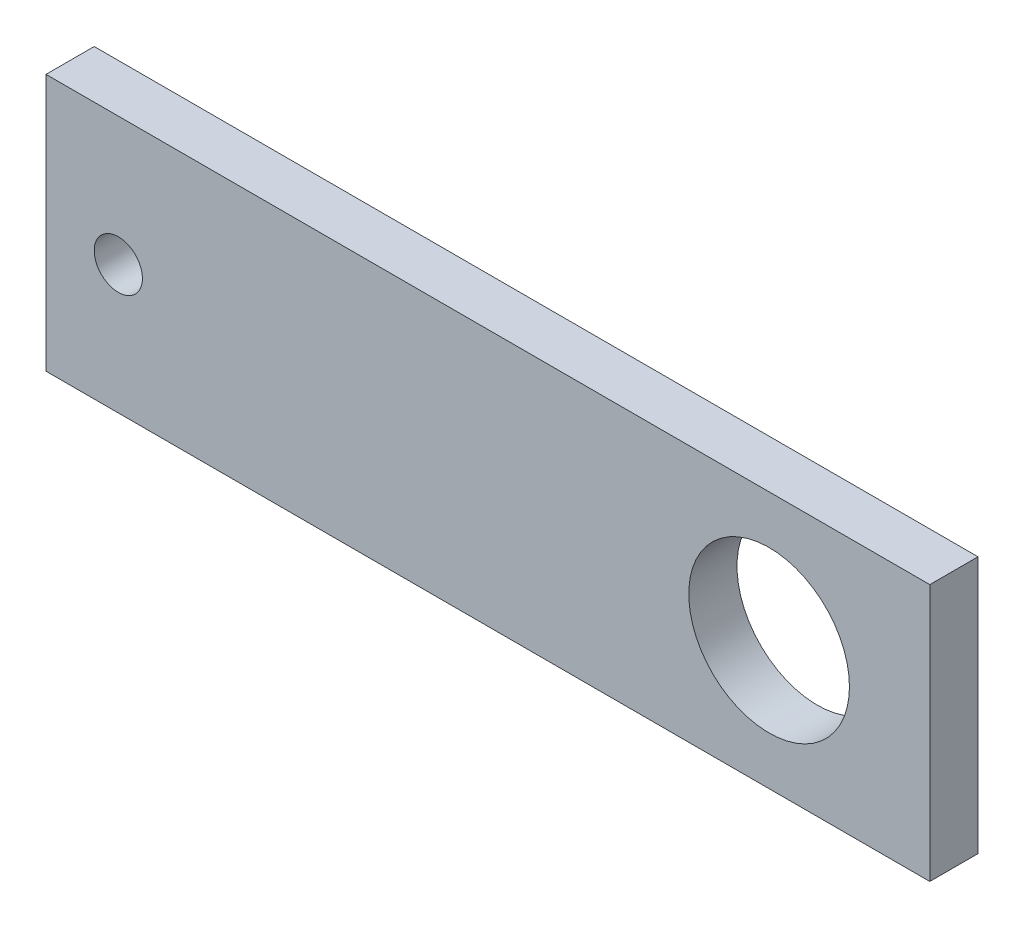
ISO-10303-21;
HEADER;
FILE_DESCRIPTION(('STEP AP214'),'2;1');
FILE_NAME('part.step','',(''),(''),'','','');
FILE_SCHEMA(('AUTOMOTIVE_DESIGN { 1 0 10303 214 1 1 1 1 }'));
ENDSEC;
DATA;
#1=APPLICATION_CONTEXT('core data for automotive mechanical design processes');
#2=APPLICATION_PROTOCOL_DEFINITION('international standard','automotive_design',2000,#1);
#3=PRODUCT_CONTEXT('',#1,'mechanical');
#4=PRODUCT('Part','Part','',(#3));
#5=PRODUCT_RELATED_PRODUCT_CATEGORY('part','',(#4));
#6=PRODUCT_DEFINITION_FORMATION('','',#4);
#7=PRODUCT_DEFINITION_CONTEXT('part definition',#1,'design');
#8=PRODUCT_DEFINITION('design','',#6,#7);
#9=PRODUCT_DEFINITION_SHAPE('','',#8);
#10=(LENGTH_UNIT() NAMED_UNIT(*) SI_UNIT(.MILLI.,.METRE.));
#11=(NAMED_UNIT(*) PLANE_ANGLE_UNIT() SI_UNIT($,.RADIAN.));
#12=(NAMED_UNIT(*) SI_UNIT($,.STERADIAN.) SOLID_ANGLE_UNIT());
#13=UNCERTAINTY_MEASURE_WITH_UNIT(LENGTH_MEASURE(1.E-05),#10,'distance_accuracy_value','');
#14=(GEOMETRIC_REPRESENTATION_CONTEXT(3) GLOBAL_UNCERTAINTY_ASSIGNED_CONTEXT((#13)) GLOBAL_UNIT_ASSIGNED_CONTEXT((#10,
#11,#12)) REPRESENTATION_CONTEXT('',''));
#15=CARTESIAN_POINT('',(0.,0.,0.));
#16=DIRECTION('',(0.,0.,1.));
#17=DIRECTION('',(1.,0.,0.));
#18=AXIS2_PLACEMENT_3D('',#15,#16,#17);
#19=CARTESIAN_POINT('',(-45.5282892641359,-15.2498887652948,3.));
#20=DIRECTION('',(0.,0.,1.));
#21=DIRECTION('',(1.,0.,0.));
#22=AXIS2_PLACEMENT_3D('',#19,#20,#21);
#23=PLANE('',#22);
#24=CARTESIAN_POINT('',(-0.528289264135851,-7.24988876529478,3.));
#25=DIRECTION('',(0.,0.,1.));
#26=DIRECTION('',(1.,0.,0.));
#27=AXIS2_PLACEMENT_3D('',#24,#25,#26);
#28=CIRCLE('',#27,5.);
#29=CARTESIAN_POINT('',(4.47171073586415,-7.24988876529478,3.));
#30=VERTEX_POINT('',#29);
#31=EDGE_CURVE('E97',#30,#30,#28,.T.);
#32=ORIENTED_EDGE('',*,*,#31,.F.);
#33=EDGE_LOOP('',(#32));
#34=FACE_BOUND('',#33,.T.);
#35=DIRECTION('',(0.,-1.,0.));
#36=VECTOR('',#35,1.);
#37=CARTESIAN_POINT('',(-45.5282892641359,0.750111234705225,3.));
#38=LINE('',#37,#36);
#39=CARTESIAN_POINT('',(-45.5282892641359,0.750111234705225,3.));
#40=VERTEX_POINT('',#39);
#41=CARTESIAN_POINT('',(-45.5282892641359,-15.2498887652948,3.));
#42=VERTEX_POINT('',#41);
#43=EDGE_CURVE('E82',#40,#42,#38,.T.);
#44=ORIENTED_EDGE('',*,*,#43,.T.);
#45=DIRECTION('',(1.,0.,0.));
#46=VECTOR('',#45,1.);
#47=CARTESIAN_POINT('',(-45.5282892641359,-15.2498887652948,3.));
#48=LINE('',#47,#46);
#49=CARTESIAN_POINT('',(9.47171073586415,-15.2498887652948,3.));
#50=VERTEX_POINT('',#49);
#51=EDGE_CURVE('E77',#42,#50,#48,.T.);
#52=ORIENTED_EDGE('',*,*,#51,.T.);
#53=DIRECTION('',(0.,1.,0.));
#54=VECTOR('',#53,1.);
#55=CARTESIAN_POINT('',(9.47171073586415,0.750111234705225,3.));
#56=LINE('',#55,#54);
#57=CARTESIAN_POINT('',(9.47171073586415,0.750111234705225,3.));
#58=VERTEX_POINT('',#57);
#59=EDGE_CURVE('E80',#50,#58,#56,.T.);
#60=ORIENTED_EDGE('',*,*,#59,.T.);
#61=DIRECTION('',(-1.,0.,0.));
#62=VECTOR('',#61,1.);
#63=CARTESIAN_POINT('',(-45.5282892641359,0.750111234705225,3.));
#64=LINE('',#63,#62);
#65=EDGE_CURVE('E47',#58,#40,#64,.T.);
#66=ORIENTED_EDGE('',*,*,#65,.T.);
#67=EDGE_LOOP('',(#44,#52,#60,#66));
#68=FACE_BOUND('',#67,.T.);
#69=CARTESIAN_POINT('',(-41.0282892641359,-7.24988876529477,3.));
#70=DIRECTION('',(0.,0.,1.));
#71=DIRECTION('',(1.,0.,0.));
#72=AXIS2_PLACEMENT_3D('',#69,#70,#71);
#73=CIRCLE('',#72,1.5);
#74=CARTESIAN_POINT('',(-39.5282892641359,-7.24988876529477,3.));
#75=VERTEX_POINT('',#74);
#76=EDGE_CURVE('E112',#75,#75,#73,.T.);
#77=ORIENTED_EDGE('',*,*,#76,.F.);
#78=EDGE_LOOP('',(#77));
#79=FACE_BOUND('',#78,.T.);
#80=ADVANCED_FACE('F30',(#34,#68,#79),#23,.T.);
#81=CARTESIAN_POINT('',(-45.5282892641359,-15.2498887652948,0.));
#82=DIRECTION('',(0.,0.,1.));
#83=DIRECTION('',(1.,0.,0.));
#84=AXIS2_PLACEMENT_3D('',#81,#82,#83);
#85=PLANE('',#84);
#86=CARTESIAN_POINT('',(-0.528289264135851,-7.24988876529478,0.));
#87=DIRECTION('',(0.,0.,1.));
#88=DIRECTION('',(1.,0.,0.));
#89=AXIS2_PLACEMENT_3D('',#86,#87,#88);
#90=CIRCLE('',#89,5.);
#91=CARTESIAN_POINT('',(4.47171073586415,-7.24988876529478,0.));
#92=VERTEX_POINT('',#91);
#93=EDGE_CURVE('E109',#92,#92,#90,.T.);
#94=ORIENTED_EDGE('',*,*,#93,.T.);
#95=EDGE_LOOP('',(#94));
#96=FACE_BOUND('',#95,.T.);
#97=DIRECTION('',(0.,-1.,0.));
#98=VECTOR('',#97,1.);
#99=CARTESIAN_POINT('',(-45.5282892641359,0.750111234705225,0.));
#100=LINE('',#99,#98);
#101=CARTESIAN_POINT('',(-45.5282892641359,0.750111234705225,0.));
#102=VERTEX_POINT('',#101);
#103=CARTESIAN_POINT('',(-45.5282892641359,-15.2498887652948,0.));
#104=VERTEX_POINT('',#103);
#105=EDGE_CURVE('E94',#102,#104,#100,.T.);
#106=ORIENTED_EDGE('',*,*,#105,.F.);
#107=DIRECTION('',(-1.,0.,0.));
#108=VECTOR('',#107,1.);
#109=CARTESIAN_POINT('',(-45.5282892641359,0.750111234705225,0.));
#110=LINE('',#109,#108);
#111=CARTESIAN_POINT('',(9.47171073586415,0.750111234705225,0.));
#112=VERTEX_POINT('',#111);
#113=EDGE_CURVE('E70',#112,#102,#110,.T.);
#114=ORIENTED_EDGE('',*,*,#113,.F.);
#115=DIRECTION('',(0.,1.,0.));
#116=VECTOR('',#115,1.);
#117=CARTESIAN_POINT('',(9.47171073586415,0.750111234705225,0.));
#118=LINE('',#117,#116);
#119=CARTESIAN_POINT('',(9.47171073586415,-15.2498887652948,0.));
#120=VERTEX_POINT('',#119);
#121=EDGE_CURVE('E64',#120,#112,#118,.T.);
#122=ORIENTED_EDGE('',*,*,#121,.F.);
#123=DIRECTION('',(1.,0.,0.));
#124=VECTOR('',#123,1.);
#125=CARTESIAN_POINT('',(-45.5282892641359,-15.2498887652948,0.));
#126=LINE('',#125,#124);
#127=EDGE_CURVE('E86',#104,#120,#126,.T.);
#128=ORIENTED_EDGE('',*,*,#127,.F.);
#129=EDGE_LOOP('',(#106,#114,#122,#128));
#130=FACE_BOUND('',#129,.T.);
#131=CARTESIAN_POINT('',(-41.0282892641359,-7.24988876529477,0.));
#132=DIRECTION('',(0.,0.,1.));
#133=DIRECTION('',(1.,0.,0.));
#134=AXIS2_PLACEMENT_3D('',#131,#132,#133);
#135=CIRCLE('',#134,1.5);
#136=CARTESIAN_POINT('',(-39.5282892641359,-7.24988876529477,0.));
#137=VERTEX_POINT('',#136);
#138=EDGE_CURVE('E115',#137,#137,#135,.T.);
#139=ORIENTED_EDGE('',*,*,#138,.T.);
#140=EDGE_LOOP('',(#139));
#141=FACE_BOUND('',#140,.T.);
#142=ADVANCED_FACE('F105',(#96,#130,#141),#85,.F.);
#143=CARTESIAN_POINT('',(-45.5282892641359,0.750111234705225,3.));
#144=DIRECTION('',(1.,0.,0.));
#145=DIRECTION('',(0.,0.,-1.));
#146=AXIS2_PLACEMENT_3D('',#143,#144,#145);
#147=PLANE('',#146);
#148=ORIENTED_EDGE('',*,*,#105,.T.);
#149=DIRECTION('',(0.,0.,-1.));
#150=VECTOR('',#149,1.);
#151=CARTESIAN_POINT('',(-45.5282892641359,-15.2498887652948,3.));
#152=LINE('',#151,#150);
#153=EDGE_CURVE('E11',#42,#104,#152,.T.);
#154=ORIENTED_EDGE('',*,*,#153,.F.);
#155=ORIENTED_EDGE('',*,*,#43,.F.);
#156=DIRECTION('',(0.,0.,-1.));
#157=VECTOR('',#156,1.);
#158=CARTESIAN_POINT('',(-45.5282892641359,0.750111234705225,3.));
#159=LINE('',#158,#157);
#160=EDGE_CURVE('E90',#40,#102,#159,.T.);
#161=ORIENTED_EDGE('',*,*,#160,.T.);
#162=EDGE_LOOP('',(#148,#154,#155,#161));
#163=FACE_BOUND('',#162,.T.);
#164=ADVANCED_FACE('F32',(#163),#147,.F.);
#165=CARTESIAN_POINT('',(-45.5282892641359,-15.2498887652948,3.));
#166=DIRECTION('',(0.,1.,0.));
#167=DIRECTION('',(0.,0.,1.));
#168=AXIS2_PLACEMENT_3D('',#165,#166,#167);
#169=PLANE('',#168);
#170=ORIENTED_EDGE('',*,*,#127,.T.);
#171=DIRECTION('',(0.,0.,-1.));
#172=VECTOR('',#171,1.);
#173=CARTESIAN_POINT('',(9.47171073586415,-15.2498887652948,3.));
#174=LINE('',#173,#172);
#175=EDGE_CURVE('E39',#50,#120,#174,.T.);
#176=ORIENTED_EDGE('',*,*,#175,.F.);
#177=ORIENTED_EDGE('',*,*,#51,.F.);
#178=ORIENTED_EDGE('',*,*,#153,.T.);
#179=EDGE_LOOP('',(#170,#176,#177,#178));
#180=FACE_BOUND('',#179,.T.);
#181=ADVANCED_FACE('F85',(#180),#169,.F.);
#182=CARTESIAN_POINT('',(9.47171073586415,0.750111234705225,3.));
#183=DIRECTION('',(-1.,0.,0.));
#184=DIRECTION('',(0.,0.,1.));
#185=AXIS2_PLACEMENT_3D('',#182,#183,#184);
#186=PLANE('',#185);
#187=ORIENTED_EDGE('',*,*,#121,.T.);
#188=DIRECTION('',(0.,0.,-1.));
#189=VECTOR('',#188,1.);
#190=CARTESIAN_POINT('',(9.47171073586415,0.750111234705225,3.));
#191=LINE('',#190,#189);
#192=EDGE_CURVE('E87',#58,#112,#191,.T.);
#193=ORIENTED_EDGE('',*,*,#192,.F.);
#194=ORIENTED_EDGE('',*,*,#59,.F.);
#195=ORIENTED_EDGE('',*,*,#175,.T.);
#196=EDGE_LOOP('',(#187,#193,#194,#195));
#197=FACE_BOUND('',#196,.T.);
#198=ADVANCED_FACE('F88',(#197),#186,.F.);
#199=CARTESIAN_POINT('',(-45.5282892641359,0.750111234705225,3.));
#200=DIRECTION('',(0.,-1.,0.));
#201=DIRECTION('',(0.,0.,-1.));
#202=AXIS2_PLACEMENT_3D('',#199,#200,#201);
#203=PLANE('',#202);
#204=ORIENTED_EDGE('',*,*,#113,.T.);
#205=ORIENTED_EDGE('',*,*,#160,.F.);
#206=ORIENTED_EDGE('',*,*,#65,.F.);
#207=ORIENTED_EDGE('',*,*,#192,.T.);
#208=EDGE_LOOP('',(#204,#205,#206,#207));
#209=FACE_BOUND('',#208,.T.);
#210=ADVANCED_FACE('F102',(#209),#203,.F.);
#211=CARTESIAN_POINT('',(-0.528289264135851,-7.24988876529478,3.));
#212=DIRECTION('',(0.,0.,-1.));
#213=DIRECTION('',(-1.,0.,0.));
#214=AXIS2_PLACEMENT_3D('',#211,#212,#213);
#215=CYLINDRICAL_SURFACE('',#214,5.);
#216=ORIENTED_EDGE('',*,*,#31,.T.);
#217=EDGE_LOOP('',(#216));
#218=FACE_BOUND('',#217,.T.);
#219=ORIENTED_EDGE('',*,*,#93,.F.);
#220=EDGE_LOOP('',(#219));
#221=FACE_BOUND('',#220,.T.);
#222=ADVANCED_FACE('F133',(#218,#221),#215,.F.);
#223=CARTESIAN_POINT('',(-41.0282892641359,-7.24988876529477,3.));
#224=DIRECTION('',(0.,0.,-1.));
#225=DIRECTION('',(-1.,0.,0.));
#226=AXIS2_PLACEMENT_3D('',#223,#224,#225);
#227=CYLINDRICAL_SURFACE('',#226,1.5);
#228=ORIENTED_EDGE('',*,*,#76,.T.);
#229=EDGE_LOOP('',(#228));
#230=FACE_BOUND('',#229,.T.);
#231=ORIENTED_EDGE('',*,*,#138,.F.);
#232=EDGE_LOOP('',(#231));
#233=FACE_BOUND('',#232,.T.);
#234=ADVANCED_FACE('F121',(#230,#233),#227,.F.);
#235=CLOSED_SHELL('',(#80,#142,#164,#181,#198,#210,#222,#234));
#236=MANIFOLD_SOLID_BREP('B2',#235);
#237=ADVANCED_BREP_SHAPE_REPRESENTATION('',(#18,#236),#14);
#238=SHAPE_DEFINITION_REPRESENTATION(#9,#237);
ENDSEC;
END-ISO-10303-21;
